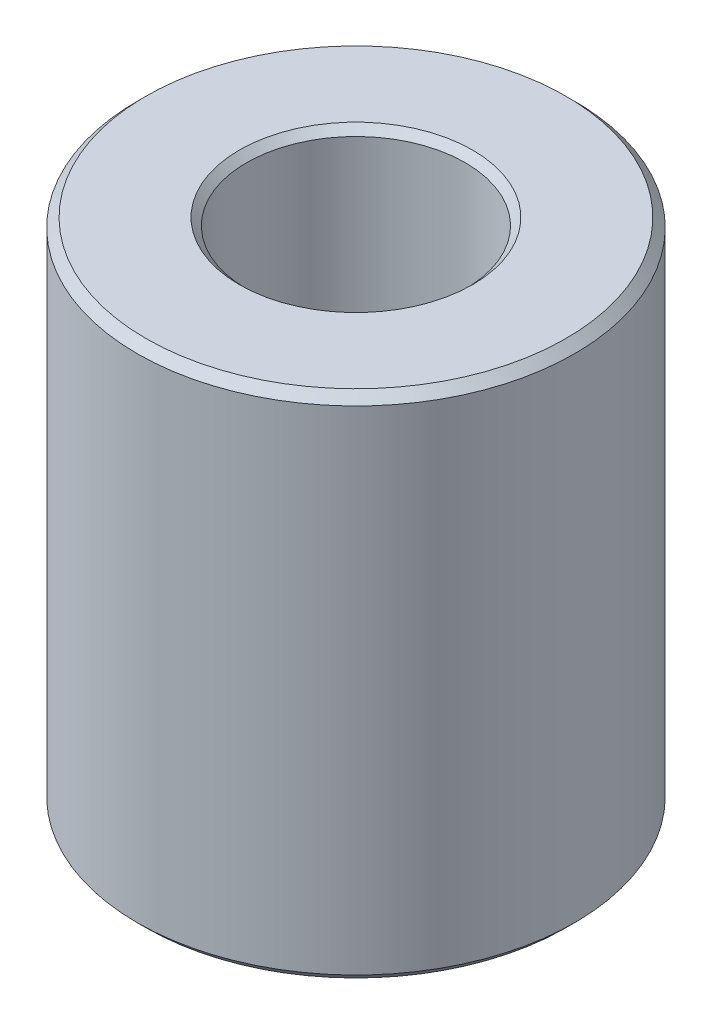
ISO-10303-21;
HEADER;
FILE_DESCRIPTION(('STEP AP214'),'2;1');
FILE_NAME('part.step','',(''),(''),'','','');
FILE_SCHEMA(('AUTOMOTIVE_DESIGN { 1 0 10303 214 1 1 1 1 }'));
ENDSEC;
DATA;
#1=APPLICATION_CONTEXT('core data for automotive mechanical design processes');
#2=APPLICATION_PROTOCOL_DEFINITION('international standard','automotive_design',2000,#1);
#3=PRODUCT_CONTEXT('',#1,'mechanical');
#4=PRODUCT('Part','Part','',(#3));
#5=PRODUCT_RELATED_PRODUCT_CATEGORY('part','',(#4));
#6=PRODUCT_DEFINITION_FORMATION('','',#4);
#7=PRODUCT_DEFINITION_CONTEXT('part definition',#1,'design');
#8=PRODUCT_DEFINITION('design','',#6,#7);
#9=PRODUCT_DEFINITION_SHAPE('','',#8);
#10=(LENGTH_UNIT() NAMED_UNIT(*) SI_UNIT(.MILLI.,.METRE.));
#11=(NAMED_UNIT(*) PLANE_ANGLE_UNIT() SI_UNIT($,.RADIAN.));
#12=(NAMED_UNIT(*) SI_UNIT($,.STERADIAN.) SOLID_ANGLE_UNIT());
#13=UNCERTAINTY_MEASURE_WITH_UNIT(LENGTH_MEASURE(1.E-05),#10,'distance_accuracy_value','');
#14=(GEOMETRIC_REPRESENTATION_CONTEXT(3) GLOBAL_UNCERTAINTY_ASSIGNED_CONTEXT((#13)) GLOBAL_UNIT_ASSIGNED_CONTEXT((#10,
#11,#12)) REPRESENTATION_CONTEXT('',''));
#15=CARTESIAN_POINT('',(0.,0.,0.));
#16=DIRECTION('',(0.,0.,1.));
#17=DIRECTION('',(1.,0.,0.));
#18=AXIS2_PLACEMENT_3D('',#15,#16,#17);
#19=CARTESIAN_POINT('',(0.,44.45,0.));
#20=DIRECTION('',(0.,-1.,0.));
#21=DIRECTION('',(0.,0.,-1.));
#22=AXIS2_PLACEMENT_3D('',#19,#20,#21);
#23=CYLINDRICAL_SURFACE('',#22,19.05);
#24=CARTESIAN_POINT('',(0.,0.762000000000006,0.));
#25=DIRECTION('',(0.,1.,0.));
#26=DIRECTION('',(0.,0.,1.));
#27=AXIS2_PLACEMENT_3D('',#24,#25,#26);
#28=CIRCLE('',#27,19.05);
#29=CARTESIAN_POINT('',(0.,0.762000000000006,19.05));
#30=VERTEX_POINT('',#29);
#31=EDGE_CURVE('E56',#30,#30,#28,.T.);
#32=ORIENTED_EDGE('',*,*,#31,.T.);
#33=EDGE_LOOP('',(#32));
#34=FACE_BOUND('',#33,.T.);
#35=CARTESIAN_POINT('',(0.,43.688,0.));
#36=DIRECTION('',(0.,1.,0.));
#37=DIRECTION('',(0.,0.,1.));
#38=AXIS2_PLACEMENT_3D('',#35,#36,#37);
#39=CIRCLE('',#38,19.05);
#40=CARTESIAN_POINT('',(0.,43.688,19.05));
#41=VERTEX_POINT('',#40);
#42=EDGE_CURVE('E59',#41,#41,#39,.F.);
#43=ORIENTED_EDGE('',*,*,#42,.T.);
#44=EDGE_LOOP('',(#43));
#45=FACE_BOUND('',#44,.T.);
#46=ADVANCED_FACE('F31',(#34,#45),#23,.T.);
#47=CARTESIAN_POINT('',(0.,44.45,0.));
#48=DIRECTION('',(0.,1.,0.));
#49=DIRECTION('',(0.,0.,1.));
#50=AXIS2_PLACEMENT_3D('',#47,#48,#49);
#51=PLANE('',#50);
#52=CARTESIAN_POINT('',(0.,44.45,0.));
#53=DIRECTION('',(0.,1.,0.));
#54=DIRECTION('',(0.,0.,1.));
#55=AXIS2_PLACEMENT_3D('',#52,#53,#54);
#56=CIRCLE('',#55,10.16);
#57=CARTESIAN_POINT('',(0.,44.45,10.16));
#58=VERTEX_POINT('',#57);
#59=EDGE_CURVE('E69',#58,#58,#56,.T.);
#60=ORIENTED_EDGE('',*,*,#59,.F.);
#61=EDGE_LOOP('',(#60));
#62=FACE_BOUND('',#61,.T.);
#63=CARTESIAN_POINT('',(0.,44.45,0.));
#64=DIRECTION('',(0.,1.,0.));
#65=DIRECTION('',(0.,0.,1.));
#66=AXIS2_PLACEMENT_3D('',#63,#64,#65);
#67=CIRCLE('',#66,18.288);
#68=CARTESIAN_POINT('',(0.,44.45,18.288));
#69=VERTEX_POINT('',#68);
#70=EDGE_CURVE('E42',#69,#69,#67,.T.);
#71=ORIENTED_EDGE('',*,*,#70,.T.);
#72=EDGE_LOOP('',(#71));
#73=FACE_BOUND('',#72,.T.);
#74=ADVANCED_FACE('F75',(#62,#73),#51,.T.);
#75=CARTESIAN_POINT('',(0.,0.,0.));
#76=DIRECTION('',(0.,1.,0.));
#77=DIRECTION('',(0.,0.,1.));
#78=AXIS2_PLACEMENT_3D('',#75,#76,#77);
#79=PLANE('',#78);
#80=CARTESIAN_POINT('',(0.,0.,0.));
#81=DIRECTION('',(0.,1.,0.));
#82=DIRECTION('',(0.,0.,1.));
#83=AXIS2_PLACEMENT_3D('',#80,#81,#82);
#84=CIRCLE('',#83,18.288);
#85=CARTESIAN_POINT('',(0.,0.,18.288));
#86=VERTEX_POINT('',#85);
#87=EDGE_CURVE('E46',#86,#86,#84,.F.);
#88=ORIENTED_EDGE('',*,*,#87,.T.);
#89=EDGE_LOOP('',(#88));
#90=FACE_BOUND('',#89,.T.);
#91=CARTESIAN_POINT('',(0.,0.,0.));
#92=DIRECTION('',(0.,1.,0.));
#93=DIRECTION('',(0.,0.,1.));
#94=AXIS2_PLACEMENT_3D('',#91,#92,#93);
#95=CIRCLE('',#94,5.41019999999999);
#96=CARTESIAN_POINT('',(0.,0.,5.41019999999999));
#97=VERTEX_POINT('',#96);
#98=EDGE_CURVE('E51',#97,#97,#95,.T.);
#99=ORIENTED_EDGE('',*,*,#98,.T.);
#100=EDGE_LOOP('',(#99));
#101=FACE_BOUND('',#100,.T.);
#102=ADVANCED_FACE('F78',(#90,#101),#79,.F.);
#103=CARTESIAN_POINT('',(0.,44.45,0.));
#104=DIRECTION('',(0.,1.,0.));
#105=DIRECTION('',(0.,0.,1.));
#106=AXIS2_PLACEMENT_3D('',#103,#104,#105);
#107=CYLINDRICAL_SURFACE('',#106,4.77519999999999);
#108=CARTESIAN_POINT('',(0.,8.382,0.));
#109=DIRECTION('',(0.,-1.,0.));
#110=DIRECTION('',(0.,0.,-1.));
#111=AXIS2_PLACEMENT_3D('',#108,#109,#110);
#112=CIRCLE('',#111,4.77519999999999);
#113=CARTESIAN_POINT('',(0.,8.382,-4.77519999999999));
#114=VERTEX_POINT('',#113);
#115=EDGE_CURVE('E49',#114,#114,#112,.F.);
#116=ORIENTED_EDGE('',*,*,#115,.T.);
#117=EDGE_LOOP('',(#116));
#118=FACE_BOUND('',#117,.T.);
#119=CARTESIAN_POINT('',(0.,0.635000000000004,0.));
#120=DIRECTION('',(0.,1.,0.));
#121=DIRECTION('',(0.,0.,1.));
#122=AXIS2_PLACEMENT_3D('',#119,#120,#121);
#123=CIRCLE('',#122,4.77519999999999);
#124=CARTESIAN_POINT('',(0.,0.635000000000004,4.77519999999999));
#125=VERTEX_POINT('',#124);
#126=EDGE_CURVE('E62',#125,#125,#123,.T.);
#127=ORIENTED_EDGE('',*,*,#126,.F.);
#128=EDGE_LOOP('',(#127));
#129=FACE_BOUND('',#128,.T.);
#130=ADVANCED_FACE('F105',(#118,#129),#107,.F.);
#131=CARTESIAN_POINT('',(0.,0.635000000000004,0.));
#132=DIRECTION('',(0.,-1.,0.));
#133=DIRECTION('',(0.,0.,-1.));
#134=AXIS2_PLACEMENT_3D('',#131,#132,#133);
#135=CONICAL_SURFACE('',#134,4.77519999999999,0.785398163397445);
#136=ORIENTED_EDGE('',*,*,#98,.F.);
#137=EDGE_LOOP('',(#136));
#138=FACE_BOUND('',#137,.T.);
#139=ORIENTED_EDGE('',*,*,#126,.T.);
#140=EDGE_LOOP('',(#139));
#141=FACE_BOUND('',#140,.T.);
#142=ADVANCED_FACE('F93',(#138,#141),#135,.F.);
#143=CARTESIAN_POINT('',(0.,0.762000000000006,0.));
#144=DIRECTION('',(0.,1.,0.));
#145=DIRECTION('',(0.,0.,1.));
#146=AXIS2_PLACEMENT_3D('',#143,#144,#145);
#147=CONICAL_SURFACE('',#146,19.05,0.785398163397446);
#148=ORIENTED_EDGE('',*,*,#87,.F.);
#149=EDGE_LOOP('',(#148));
#150=FACE_BOUND('',#149,.T.);
#151=ORIENTED_EDGE('',*,*,#31,.F.);
#152=EDGE_LOOP('',(#151));
#153=FACE_BOUND('',#152,.T.);
#154=ADVANCED_FACE('F85',(#150,#153),#147,.T.);
#155=CARTESIAN_POINT('',(0.,44.45,0.));
#156=DIRECTION('',(0.,-1.,0.));
#157=DIRECTION('',(0.,0.,-1.));
#158=AXIS2_PLACEMENT_3D('',#155,#156,#157);
#159=CONICAL_SURFACE('',#158,18.288,0.785398163397446);
#160=ORIENTED_EDGE('',*,*,#42,.F.);
#161=EDGE_LOOP('',(#160));
#162=FACE_BOUND('',#161,.T.);
#163=ORIENTED_EDGE('',*,*,#70,.F.);
#164=EDGE_LOOP('',(#163));
#165=FACE_BOUND('',#164,.T.);
#166=ADVANCED_FACE('F82',(#162,#165),#159,.T.);
#167=CARTESIAN_POINT('',(0.,8.382,0.));
#168=DIRECTION('',(0.,-1.,0.));
#169=DIRECTION('',(0.,0.,-1.));
#170=AXIS2_PLACEMENT_3D('',#167,#168,#169);
#171=PLANE('',#170);
#172=CARTESIAN_POINT('',(0.,8.382,0.));
#173=DIRECTION('',(0.,-1.,0.));
#174=DIRECTION('',(0.,0.,-1.));
#175=AXIS2_PLACEMENT_3D('',#172,#173,#174);
#176=CIRCLE('',#175,9.27099999999999);
#177=CARTESIAN_POINT('',(0.,8.382,-9.27099999999999));
#178=VERTEX_POINT('',#177);
#179=EDGE_CURVE('E38',#178,#178,#176,.F.);
#180=ORIENTED_EDGE('',*,*,#179,.T.);
#181=EDGE_LOOP('',(#180));
#182=FACE_BOUND('',#181,.T.);
#183=ORIENTED_EDGE('',*,*,#115,.F.);
#184=EDGE_LOOP('',(#183));
#185=FACE_BOUND('',#184,.T.);
#186=ADVANCED_FACE('F84',(#182,#185),#171,.F.);
#187=CARTESIAN_POINT('',(0.,44.45,0.));
#188=DIRECTION('',(0.,1.,0.));
#189=DIRECTION('',(0.,0.,1.));
#190=AXIS2_PLACEMENT_3D('',#187,#188,#189);
#191=CYLINDRICAL_SURFACE('',#190,9.52499999999999);
#192=CARTESIAN_POINT('',(0.,8.636,0.));
#193=DIRECTION('',(0.,-1.,0.));
#194=DIRECTION('',(0.,0.,-1.));
#195=AXIS2_PLACEMENT_3D('',#192,#193,#194);
#196=CIRCLE('',#195,9.52499999999999);
#197=CARTESIAN_POINT('',(0.,8.636,-9.52499999999999));
#198=VERTEX_POINT('',#197);
#199=EDGE_CURVE('E10',#198,#198,#196,.T.);
#200=ORIENTED_EDGE('',*,*,#199,.T.);
#201=EDGE_LOOP('',(#200));
#202=FACE_BOUND('',#201,.T.);
#203=CARTESIAN_POINT('',(0.,43.815,0.));
#204=DIRECTION('',(0.,1.,0.));
#205=DIRECTION('',(0.,0.,1.));
#206=AXIS2_PLACEMENT_3D('',#203,#204,#205);
#207=CIRCLE('',#206,9.525);
#208=CARTESIAN_POINT('',(0.,43.815,9.525));
#209=VERTEX_POINT('',#208);
#210=EDGE_CURVE('E52',#209,#209,#207,.T.);
#211=ORIENTED_EDGE('',*,*,#210,.T.);
#212=EDGE_LOOP('',(#211));
#213=FACE_BOUND('',#212,.T.);
#214=ADVANCED_FACE('F91',(#202,#213),#191,.F.);
#215=CARTESIAN_POINT('',(0.,44.45,0.));
#216=DIRECTION('',(0.,1.,0.));
#217=DIRECTION('',(0.,0.,1.));
#218=AXIS2_PLACEMENT_3D('',#215,#216,#217);
#219=CONICAL_SURFACE('',#218,10.16,0.78539816339745);
#220=ORIENTED_EDGE('',*,*,#210,.F.);
#221=EDGE_LOOP('',(#220));
#222=FACE_BOUND('',#221,.T.);
#223=ORIENTED_EDGE('',*,*,#59,.T.);
#224=EDGE_LOOP('',(#223));
#225=FACE_BOUND('',#224,.T.);
#226=ADVANCED_FACE('F73',(#222,#225),#219,.F.);
#227=CARTESIAN_POINT('',(0.,8.382,0.));
#228=DIRECTION('',(0.,1.,0.));
#229=DIRECTION('',(0.,0.,1.));
#230=AXIS2_PLACEMENT_3D('',#227,#228,#229);
#231=CONICAL_SURFACE('',#230,9.27099999999999,0.785398163397448);
#232=ORIENTED_EDGE('',*,*,#199,.F.);
#233=EDGE_LOOP('',(#232));
#234=FACE_BOUND('',#233,.T.);
#235=ORIENTED_EDGE('',*,*,#179,.F.);
#236=EDGE_LOOP('',(#235));
#237=FACE_BOUND('',#236,.T.);
#238=ADVANCED_FACE('F33',(#234,#237),#231,.F.);
#239=CLOSED_SHELL('',(#46,#74,#102,#130,#142,#154,#166,#186,#214,#226,#238));
#240=MANIFOLD_SOLID_BREP('B2',#239);
#241=ADVANCED_BREP_SHAPE_REPRESENTATION('',(#18,#240),#14);
#242=SHAPE_DEFINITION_REPRESENTATION(#9,#241);
ENDSEC;
END-ISO-10303-21;
